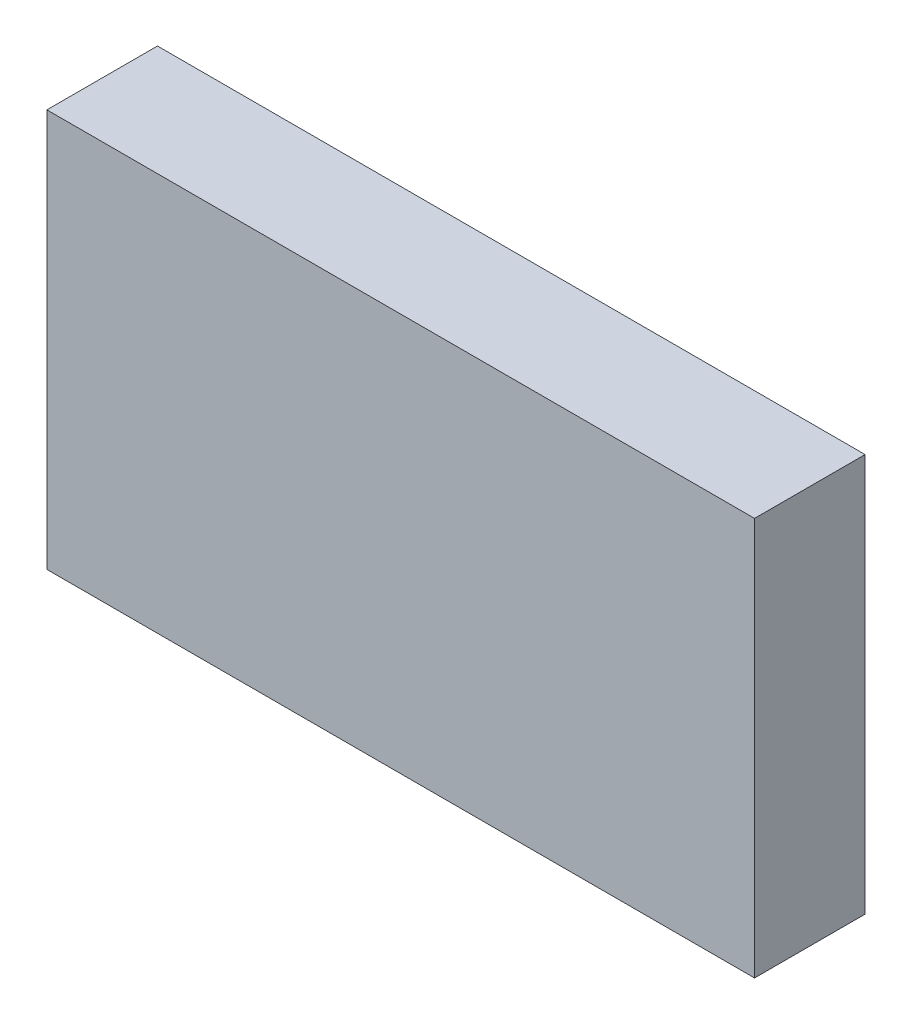
ISO-10303-21;
HEADER;
FILE_DESCRIPTION(('STEP AP214'),'2;1');
FILE_NAME('part.step','',(''),(''),'','','');
FILE_SCHEMA(('AUTOMOTIVE_DESIGN { 1 0 10303 214 1 1 1 1 }'));
ENDSEC;
DATA;
#1=APPLICATION_CONTEXT('core data for automotive mechanical design processes');
#2=APPLICATION_PROTOCOL_DEFINITION('international standard','automotive_design',2000,#1);
#3=PRODUCT_CONTEXT('',#1,'mechanical');
#4=PRODUCT('Part','Part','',(#3));
#5=PRODUCT_RELATED_PRODUCT_CATEGORY('part','',(#4));
#6=PRODUCT_DEFINITION_FORMATION('','',#4);
#7=PRODUCT_DEFINITION_CONTEXT('part definition',#1,'design');
#8=PRODUCT_DEFINITION('design','',#6,#7);
#9=PRODUCT_DEFINITION_SHAPE('','',#8);
#10=(LENGTH_UNIT() NAMED_UNIT(*) SI_UNIT(.MILLI.,.METRE.));
#11=(NAMED_UNIT(*) PLANE_ANGLE_UNIT() SI_UNIT($,.RADIAN.));
#12=(NAMED_UNIT(*) SI_UNIT($,.STERADIAN.) SOLID_ANGLE_UNIT());
#13=UNCERTAINTY_MEASURE_WITH_UNIT(LENGTH_MEASURE(1.E-05),#10,'distance_accuracy_value','');
#14=(GEOMETRIC_REPRESENTATION_CONTEXT(3) GLOBAL_UNCERTAINTY_ASSIGNED_CONTEXT((#13)) GLOBAL_UNIT_ASSIGNED_CONTEXT((#10,
#11,#12)) REPRESENTATION_CONTEXT('',''));
#15=CARTESIAN_POINT('',(0.,0.,0.));
#16=DIRECTION('',(0.,0.,1.));
#17=DIRECTION('',(1.,0.,0.));
#18=AXIS2_PLACEMENT_3D('',#15,#16,#17);
#19=CARTESIAN_POINT('',(16.,9.,5.));
#20=DIRECTION('',(-1.,0.,0.));
#21=DIRECTION('',(0.,-1.,0.));
#22=AXIS2_PLACEMENT_3D('',#19,#20,#21);
#23=PLANE('',#22);
#24=DIRECTION('',(0.,1.,0.));
#25=VECTOR('',#24,1.);
#26=CARTESIAN_POINT('',(16.,9.,0.));
#27=LINE('',#26,#25);
#28=CARTESIAN_POINT('',(16.,-9.,0.));
#29=VERTEX_POINT('',#28);
#30=CARTESIAN_POINT('',(16.,9.,0.));
#31=VERTEX_POINT('',#30);
#32=EDGE_CURVE('E107',#29,#31,#27,.T.);
#33=ORIENTED_EDGE('',*,*,#32,.T.);
#34=DIRECTION('',(0.,0.,-1.));
#35=VECTOR('',#34,1.);
#36=CARTESIAN_POINT('',(16.,9.,5.));
#37=LINE('',#36,#35);
#38=CARTESIAN_POINT('',(16.,9.,5.));
#39=VERTEX_POINT('',#38);
#40=EDGE_CURVE('E11',#39,#31,#37,.T.);
#41=ORIENTED_EDGE('',*,*,#40,.F.);
#42=DIRECTION('',(0.,1.,0.));
#43=VECTOR('',#42,1.);
#44=CARTESIAN_POINT('',(16.,9.,5.));
#45=LINE('',#44,#43);
#46=CARTESIAN_POINT('',(16.,-9.,5.));
#47=VERTEX_POINT('',#46);
#48=EDGE_CURVE('E91',#47,#39,#45,.T.);
#49=ORIENTED_EDGE('',*,*,#48,.F.);
#50=DIRECTION('',(0.,0.,-1.));
#51=VECTOR('',#50,1.);
#52=CARTESIAN_POINT('',(16.,-9.,5.));
#53=LINE('',#52,#51);
#54=EDGE_CURVE('E103',#47,#29,#53,.T.);
#55=ORIENTED_EDGE('',*,*,#54,.T.);
#56=EDGE_LOOP('',(#33,#41,#49,#55));
#57=FACE_BOUND('',#56,.T.);
#58=ADVANCED_FACE('F39',(#57),#23,.F.);
#59=CARTESIAN_POINT('',(-16.,9.,5.));
#60=DIRECTION('',(0.,-1.,0.));
#61=DIRECTION('',(0.,0.,-1.));
#62=AXIS2_PLACEMENT_3D('',#59,#60,#61);
#63=PLANE('',#62);
#64=DIRECTION('',(-1.,0.,0.));
#65=VECTOR('',#64,1.);
#66=CARTESIAN_POINT('',(-16.,9.,0.));
#67=LINE('',#66,#65);
#68=CARTESIAN_POINT('',(-16.,9.,0.));
#69=VERTEX_POINT('',#68);
#70=EDGE_CURVE('E96',#31,#69,#67,.T.);
#71=ORIENTED_EDGE('',*,*,#70,.T.);
#72=DIRECTION('',(0.,0.,-1.));
#73=VECTOR('',#72,1.);
#74=CARTESIAN_POINT('',(-16.,9.,5.));
#75=LINE('',#74,#73);
#76=CARTESIAN_POINT('',(-16.,9.,5.));
#77=VERTEX_POINT('',#76);
#78=EDGE_CURVE('E48',#77,#69,#75,.T.);
#79=ORIENTED_EDGE('',*,*,#78,.F.);
#80=DIRECTION('',(-1.,0.,0.));
#81=VECTOR('',#80,1.);
#82=CARTESIAN_POINT('',(-16.,9.,5.));
#83=LINE('',#82,#81);
#84=EDGE_CURVE('E86',#39,#77,#83,.T.);
#85=ORIENTED_EDGE('',*,*,#84,.F.);
#86=ORIENTED_EDGE('',*,*,#40,.T.);
#87=EDGE_LOOP('',(#71,#79,#85,#86));
#88=FACE_BOUND('',#87,.T.);
#89=ADVANCED_FACE('F95',(#88),#63,.F.);
#90=CARTESIAN_POINT('',(-16.,9.,5.));
#91=DIRECTION('',(1.,0.,0.));
#92=DIRECTION('',(0.,1.,0.));
#93=AXIS2_PLACEMENT_3D('',#90,#91,#92);
#94=PLANE('',#93);
#95=DIRECTION('',(0.,-1.,0.));
#96=VECTOR('',#95,1.);
#97=CARTESIAN_POINT('',(-16.,9.,0.));
#98=LINE('',#97,#96);
#99=CARTESIAN_POINT('',(-16.,-9.,0.));
#100=VERTEX_POINT('',#99);
#101=EDGE_CURVE('E73',#69,#100,#98,.T.);
#102=ORIENTED_EDGE('',*,*,#101,.T.);
#103=DIRECTION('',(0.,0.,-1.));
#104=VECTOR('',#103,1.);
#105=CARTESIAN_POINT('',(-16.,-9.,5.));
#106=LINE('',#105,#104);
#107=CARTESIAN_POINT('',(-16.,-9.,5.));
#108=VERTEX_POINT('',#107);
#109=EDGE_CURVE('E98',#108,#100,#106,.T.);
#110=ORIENTED_EDGE('',*,*,#109,.F.);
#111=DIRECTION('',(0.,-1.,0.));
#112=VECTOR('',#111,1.);
#113=CARTESIAN_POINT('',(-16.,9.,5.));
#114=LINE('',#113,#112);
#115=EDGE_CURVE('E89',#77,#108,#114,.T.);
#116=ORIENTED_EDGE('',*,*,#115,.F.);
#117=ORIENTED_EDGE('',*,*,#78,.T.);
#118=EDGE_LOOP('',(#102,#110,#116,#117));
#119=FACE_BOUND('',#118,.T.);
#120=ADVANCED_FACE('F99',(#119),#94,.F.);
#121=CARTESIAN_POINT('',(-16.,-9.,5.));
#122=DIRECTION('',(0.,1.,0.));
#123=DIRECTION('',(0.,0.,1.));
#124=AXIS2_PLACEMENT_3D('',#121,#122,#123);
#125=PLANE('',#124);
#126=DIRECTION('',(1.,0.,0.));
#127=VECTOR('',#126,1.);
#128=CARTESIAN_POINT('',(-16.,-9.,0.));
#129=LINE('',#128,#127);
#130=EDGE_CURVE('E79',#100,#29,#129,.T.);
#131=ORIENTED_EDGE('',*,*,#130,.T.);
#132=ORIENTED_EDGE('',*,*,#54,.F.);
#133=DIRECTION('',(1.,0.,0.));
#134=VECTOR('',#133,1.);
#135=CARTESIAN_POINT('',(-16.,-9.,5.));
#136=LINE('',#135,#134);
#137=EDGE_CURVE('E56',#108,#47,#136,.T.);
#138=ORIENTED_EDGE('',*,*,#137,.F.);
#139=ORIENTED_EDGE('',*,*,#109,.T.);
#140=EDGE_LOOP('',(#131,#132,#138,#139));
#141=FACE_BOUND('',#140,.T.);
#142=ADVANCED_FACE('F120',(#141),#125,.F.);
#143=CARTESIAN_POINT('',(0.,0.,5.));
#144=DIRECTION('',(0.,0.,1.));
#145=DIRECTION('',(1.,0.,0.));
#146=AXIS2_PLACEMENT_3D('',#143,#144,#145);
#147=PLANE('',#146);
#148=ORIENTED_EDGE('',*,*,#48,.T.);
#149=ORIENTED_EDGE('',*,*,#84,.T.);
#150=ORIENTED_EDGE('',*,*,#115,.T.);
#151=ORIENTED_EDGE('',*,*,#137,.T.);
#152=EDGE_LOOP('',(#148,#149,#150,#151));
#153=FACE_BOUND('',#152,.T.);
#154=ADVANCED_FACE('F87',(#153),#147,.T.);
#155=CARTESIAN_POINT('',(0.,0.,0.));
#156=DIRECTION('',(0.,0.,1.));
#157=DIRECTION('',(1.,0.,0.));
#158=AXIS2_PLACEMENT_3D('',#155,#156,#157);
#159=PLANE('',#158);
#160=ORIENTED_EDGE('',*,*,#32,.F.);
#161=ORIENTED_EDGE('',*,*,#130,.F.);
#162=ORIENTED_EDGE('',*,*,#101,.F.);
#163=ORIENTED_EDGE('',*,*,#70,.F.);
#164=EDGE_LOOP('',(#160,#161,#162,#163));
#165=FACE_BOUND('',#164,.T.);
#166=ADVANCED_FACE('F123',(#165),#159,.F.);
#167=CLOSED_SHELL('',(#58,#89,#120,#142,#154,#166));
#168=MANIFOLD_SOLID_BREP('B2',#167);
#169=ADVANCED_BREP_SHAPE_REPRESENTATION('',(#18,#168),#14);
#170=SHAPE_DEFINITION_REPRESENTATION(#9,#169);
ENDSEC;
END-ISO-10303-21;
